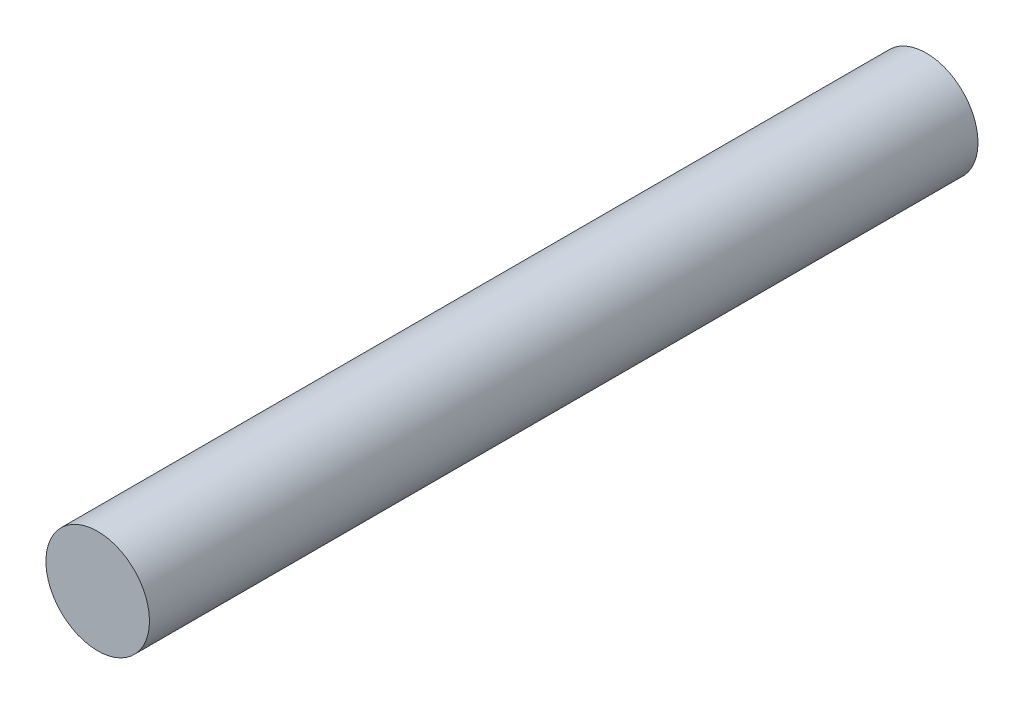
ISO-10303-21;
HEADER;
FILE_DESCRIPTION(('STEP AP214'),'2;1');
FILE_NAME('part.step','',(''),(''),'','','');
FILE_SCHEMA(('AUTOMOTIVE_DESIGN { 1 0 10303 214 1 1 1 1 }'));
ENDSEC;
DATA;
#1=APPLICATION_CONTEXT('core data for automotive mechanical design processes');
#2=APPLICATION_PROTOCOL_DEFINITION('international standard','automotive_design',2000,#1);
#3=PRODUCT_CONTEXT('',#1,'mechanical');
#4=PRODUCT('Part','Part','',(#3));
#5=PRODUCT_RELATED_PRODUCT_CATEGORY('part','',(#4));
#6=PRODUCT_DEFINITION_FORMATION('','',#4);
#7=PRODUCT_DEFINITION_CONTEXT('part definition',#1,'design');
#8=PRODUCT_DEFINITION('design','',#6,#7);
#9=PRODUCT_DEFINITION_SHAPE('','',#8);
#10=(LENGTH_UNIT() NAMED_UNIT(*) SI_UNIT(.MILLI.,.METRE.));
#11=(NAMED_UNIT(*) PLANE_ANGLE_UNIT() SI_UNIT($,.RADIAN.));
#12=(NAMED_UNIT(*) SI_UNIT($,.STERADIAN.) SOLID_ANGLE_UNIT());
#13=UNCERTAINTY_MEASURE_WITH_UNIT(LENGTH_MEASURE(1.E-05),#10,'distance_accuracy_value','');
#14=(GEOMETRIC_REPRESENTATION_CONTEXT(3) GLOBAL_UNCERTAINTY_ASSIGNED_CONTEXT((#13)) GLOBAL_UNIT_ASSIGNED_CONTEXT((#10,
#11,#12)) REPRESENTATION_CONTEXT('',''));
#15=CARTESIAN_POINT('',(0.,0.,0.));
#16=DIRECTION('',(0.,0.,1.));
#17=DIRECTION('',(1.,0.,0.));
#18=AXIS2_PLACEMENT_3D('',#15,#16,#17);
#19=CARTESIAN_POINT('',(0.,0.,25.4));
#20=DIRECTION('',(0.,0.,-1.));
#21=DIRECTION('',(-1.,0.,0.));
#22=AXIS2_PLACEMENT_3D('',#19,#20,#21);
#23=CYLINDRICAL_SURFACE('',#22,1.5875);
#24=CARTESIAN_POINT('',(0.,0.,25.4));
#25=DIRECTION('',(0.,0.,1.));
#26=DIRECTION('',(1.,0.,0.));
#27=AXIS2_PLACEMENT_3D('',#24,#25,#26);
#28=CIRCLE('',#27,1.5875);
#29=CARTESIAN_POINT('',(1.5875,0.,25.4));
#30=VERTEX_POINT('',#29);
#31=EDGE_CURVE('E10',#30,#30,#28,.T.);
#32=ORIENTED_EDGE('',*,*,#31,.F.);
#33=EDGE_LOOP('',(#32));
#34=FACE_BOUND('',#33,.T.);
#35=CARTESIAN_POINT('',(0.,0.,0.));
#36=DIRECTION('',(0.,0.,1.));
#37=DIRECTION('',(1.,0.,0.));
#38=AXIS2_PLACEMENT_3D('',#35,#36,#37);
#39=CIRCLE('',#38,1.5875);
#40=CARTESIAN_POINT('',(1.5875,0.,0.));
#41=VERTEX_POINT('',#40);
#42=EDGE_CURVE('E40',#41,#41,#39,.T.);
#43=ORIENTED_EDGE('',*,*,#42,.T.);
#44=EDGE_LOOP('',(#43));
#45=FACE_BOUND('',#44,.T.);
#46=ADVANCED_FACE('F37',(#34,#45),#23,.T.);
#47=CARTESIAN_POINT('',(0.,0.,25.4));
#48=DIRECTION('',(0.,0.,1.));
#49=DIRECTION('',(1.,0.,0.));
#50=AXIS2_PLACEMENT_3D('',#47,#48,#49);
#51=PLANE('',#50);
#52=ORIENTED_EDGE('',*,*,#31,.T.);
#53=EDGE_LOOP('',(#52));
#54=FACE_BOUND('',#53,.T.);
#55=ADVANCED_FACE('F54',(#54),#51,.T.);
#56=CARTESIAN_POINT('',(0.,0.,0.));
#57=DIRECTION('',(0.,0.,1.));
#58=DIRECTION('',(1.,0.,0.));
#59=AXIS2_PLACEMENT_3D('',#56,#57,#58);
#60=PLANE('',#59);
#61=ORIENTED_EDGE('',*,*,#42,.F.);
#62=EDGE_LOOP('',(#61));
#63=FACE_BOUND('',#62,.T.);
#64=ADVANCED_FACE('F52',(#63),#60,.F.);
#65=CLOSED_SHELL('',(#46,#55,#64));
#66=MANIFOLD_SOLID_BREP('B2',#65);
#67=ADVANCED_BREP_SHAPE_REPRESENTATION('',(#18,#66),#14);
#68=SHAPE_DEFINITION_REPRESENTATION(#9,#67);
ENDSEC;
END-ISO-10303-21;
